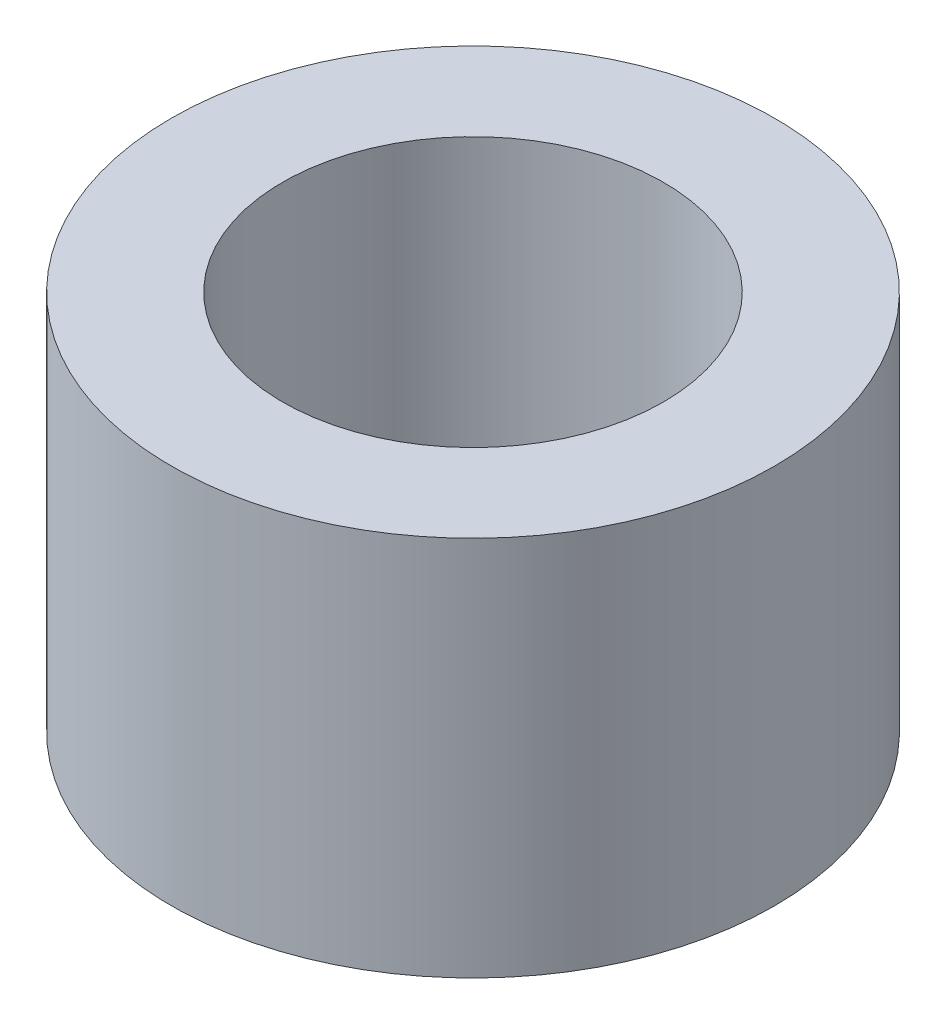
ISO-10303-21;
HEADER;
FILE_DESCRIPTION(('STEP AP214'),'2;1');
FILE_NAME('part.step','',(''),(''),'','','');
FILE_SCHEMA(('AUTOMOTIVE_DESIGN { 1 0 10303 214 1 1 1 1 }'));
ENDSEC;
DATA;
#1=APPLICATION_CONTEXT('core data for automotive mechanical design processes');
#2=APPLICATION_PROTOCOL_DEFINITION('international standard','automotive_design',2000,#1);
#3=PRODUCT_CONTEXT('',#1,'mechanical');
#4=PRODUCT('Part','Part','',(#3));
#5=PRODUCT_RELATED_PRODUCT_CATEGORY('part','',(#4));
#6=PRODUCT_DEFINITION_FORMATION('','',#4);
#7=PRODUCT_DEFINITION_CONTEXT('part definition',#1,'design');
#8=PRODUCT_DEFINITION('design','',#6,#7);
#9=PRODUCT_DEFINITION_SHAPE('','',#8);
#10=(LENGTH_UNIT() NAMED_UNIT(*) SI_UNIT(.MILLI.,.METRE.));
#11=(NAMED_UNIT(*) PLANE_ANGLE_UNIT() SI_UNIT($,.RADIAN.));
#12=(NAMED_UNIT(*) SI_UNIT($,.STERADIAN.) SOLID_ANGLE_UNIT());
#13=UNCERTAINTY_MEASURE_WITH_UNIT(LENGTH_MEASURE(1.E-05),#10,'distance_accuracy_value','');
#14=(GEOMETRIC_REPRESENTATION_CONTEXT(3) GLOBAL_UNCERTAINTY_ASSIGNED_CONTEXT((#13)) GLOBAL_UNIT_ASSIGNED_CONTEXT((#10,
#11,#12)) REPRESENTATION_CONTEXT('',''));
#15=CARTESIAN_POINT('',(0.,0.,0.));
#16=DIRECTION('',(0.,0.,1.));
#17=DIRECTION('',(1.,0.,0.));
#18=AXIS2_PLACEMENT_3D('',#15,#16,#17);
#19=CARTESIAN_POINT('',(0.,10.4,0.));
#20=DIRECTION('',(0.,1.,0.));
#21=DIRECTION('',(1.,0.,0.));
#22=AXIS2_PLACEMENT_3D('',#19,#20,#21);
#23=PLANE('',#22);
#24=CARTESIAN_POINT('',(0.,10.4,0.));
#25=DIRECTION('',(0.,1.,0.));
#26=DIRECTION('',(-1.,0.,0.));
#27=AXIS2_PLACEMENT_3D('',#24,#25,#26);
#28=CIRCLE('',#27,3.);
#29=CARTESIAN_POINT('',(3.,10.4,0.));
#30=VERTEX_POINT('',#29);
#31=EDGE_CURVE('E19',#30,#30,#28,.T.);
#32=ORIENTED_EDGE('',*,*,#31,.T.);
#33=EDGE_LOOP('',(#32));
#34=FACE_BOUND('',#33,.T.);
#35=CARTESIAN_POINT('',(0.,10.4,0.));
#36=DIRECTION('',(0.,-1.,0.));
#37=DIRECTION('',(-1.,0.,0.));
#38=AXIS2_PLACEMENT_3D('',#35,#36,#37);
#39=CIRCLE('',#38,4.75);
#40=CARTESIAN_POINT('',(4.75,10.4,0.));
#41=VERTEX_POINT('',#40);
#42=EDGE_CURVE('E80',#41,#41,#39,.T.);
#43=ORIENTED_EDGE('',*,*,#42,.T.);
#44=EDGE_LOOP('',(#43));
#45=FACE_BOUND('',#44,.T.);
#46=ADVANCED_FACE('F16',(#34,#45),#23,.F.);
#47=CARTESIAN_POINT('',(0.,16.4,0.));
#48=DIRECTION('',(0.,1.,0.));
#49=DIRECTION('',(1.,0.,0.));
#50=AXIS2_PLACEMENT_3D('',#47,#48,#49);
#51=PLANE('',#50);
#52=CARTESIAN_POINT('',(0.,16.4,0.));
#53=DIRECTION('',(0.,-1.,0.));
#54=DIRECTION('',(-1.,0.,0.));
#55=AXIS2_PLACEMENT_3D('',#52,#53,#54);
#56=CIRCLE('',#55,3.);
#57=CARTESIAN_POINT('',(3.,16.4,0.));
#58=VERTEX_POINT('',#57);
#59=EDGE_CURVE('E58',#58,#58,#56,.T.);
#60=ORIENTED_EDGE('',*,*,#59,.T.);
#61=EDGE_LOOP('',(#60));
#62=FACE_BOUND('',#61,.T.);
#63=CARTESIAN_POINT('',(0.,16.4,0.));
#64=DIRECTION('',(0.,1.,0.));
#65=DIRECTION('',(-1.,0.,0.));
#66=AXIS2_PLACEMENT_3D('',#63,#64,#65);
#67=CIRCLE('',#66,4.75);
#68=CARTESIAN_POINT('',(4.75,16.4,0.));
#69=VERTEX_POINT('',#68);
#70=EDGE_CURVE('E11',#69,#69,#67,.T.);
#71=ORIENTED_EDGE('',*,*,#70,.T.);
#72=EDGE_LOOP('',(#71));
#73=FACE_BOUND('',#72,.T.);
#74=ADVANCED_FACE('F107',(#62,#73),#51,.T.);
#75=CARTESIAN_POINT('',(0.,16.4,0.));
#76=DIRECTION('',(0.,-1.,0.));
#77=DIRECTION('',(-1.,0.,0.));
#78=AXIS2_PLACEMENT_3D('',#75,#76,#77);
#79=CYLINDRICAL_SURFACE('',#78,4.75);
#80=ORIENTED_EDGE('',*,*,#42,.F.);
#81=DIRECTION('',(0.,1.,0.));
#82=VECTOR('',#81,1.);
#83=CARTESIAN_POINT('',(4.75,16.4,0.));
#84=LINE('',#83,#82);
#85=EDGE_CURVE('E25',#41,#69,#84,.T.);
#86=ORIENTED_EDGE('',*,*,#85,.T.);
#87=ORIENTED_EDGE('',*,*,#70,.F.);
#88=ORIENTED_EDGE('',*,*,#85,.F.);
#89=EDGE_LOOP('',(#80,#86,#87,#88));
#90=FACE_BOUND('',#89,.T.);
#91=ADVANCED_FACE('F96',(#90),#79,.T.);
#92=CARTESIAN_POINT('',(0.,16.4,0.));
#93=DIRECTION('',(0.,-1.,0.));
#94=DIRECTION('',(-1.,0.,0.));
#95=AXIS2_PLACEMENT_3D('',#92,#93,#94);
#96=CYLINDRICAL_SURFACE('',#95,3.);
#97=ORIENTED_EDGE('',*,*,#31,.F.);
#98=DIRECTION('',(0.,1.,0.));
#99=VECTOR('',#98,1.);
#100=CARTESIAN_POINT('',(3.,16.4,0.));
#101=LINE('',#100,#99);
#102=EDGE_CURVE('E55',#30,#58,#101,.T.);
#103=ORIENTED_EDGE('',*,*,#102,.T.);
#104=ORIENTED_EDGE('',*,*,#59,.F.);
#105=ORIENTED_EDGE('',*,*,#102,.F.);
#106=EDGE_LOOP('',(#97,#103,#104,#105));
#107=FACE_BOUND('',#106,.T.);
#108=ADVANCED_FACE('F57',(#107),#96,.F.);
#109=CLOSED_SHELL('',(#46,#74,#91,#108));
#110=MANIFOLD_SOLID_BREP('B1',#109);
#111=ADVANCED_BREP_SHAPE_REPRESENTATION('',(#18,#110),#14);
#112=SHAPE_DEFINITION_REPRESENTATION(#9,#111);
ENDSEC;
END-ISO-10303-21;
